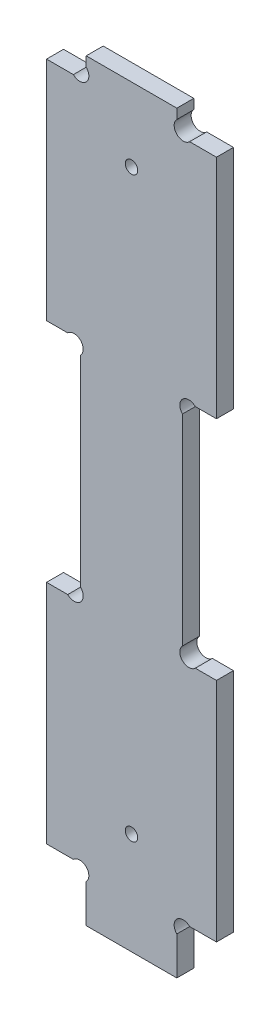
ISO-10303-21;
HEADER;
FILE_DESCRIPTION(('STEP AP214'),'2;1');
FILE_NAME('part.step','',(''),(''),'','','');
FILE_SCHEMA(('AUTOMOTIVE_DESIGN { 1 0 10303 214 1 1 1 1 }'));
ENDSEC;
DATA;
#1=APPLICATION_CONTEXT('core data for automotive mechanical design processes');
#2=APPLICATION_PROTOCOL_DEFINITION('international standard','automotive_design',2000,#1);
#3=PRODUCT_CONTEXT('',#1,'mechanical');
#4=PRODUCT('Part','Part','',(#3));
#5=PRODUCT_RELATED_PRODUCT_CATEGORY('part','',(#4));
#6=PRODUCT_DEFINITION_FORMATION('','',#4);
#7=PRODUCT_DEFINITION_CONTEXT('part definition',#1,'design');
#8=PRODUCT_DEFINITION('design','',#6,#7);
#9=PRODUCT_DEFINITION_SHAPE('','',#8);
#10=(LENGTH_UNIT() NAMED_UNIT(*) SI_UNIT(.MILLI.,.METRE.));
#11=(NAMED_UNIT(*) PLANE_ANGLE_UNIT() SI_UNIT($,.RADIAN.));
#12=(NAMED_UNIT(*) SI_UNIT($,.STERADIAN.) SOLID_ANGLE_UNIT());
#13=UNCERTAINTY_MEASURE_WITH_UNIT(LENGTH_MEASURE(1.E-05),#10,'distance_accuracy_value','');
#14=(GEOMETRIC_REPRESENTATION_CONTEXT(3) GLOBAL_UNCERTAINTY_ASSIGNED_CONTEXT((#13)) GLOBAL_UNIT_ASSIGNED_CONTEXT((#10,
#11,#12)) REPRESENTATION_CONTEXT('',''));
#15=CARTESIAN_POINT('',(0.,0.,0.));
#16=DIRECTION('',(0.,0.,1.));
#17=DIRECTION('',(1.,0.,0.));
#18=AXIS2_PLACEMENT_3D('',#15,#16,#17);
#19=CARTESIAN_POINT('',(30.,49.,3.));
#20=DIRECTION('',(-1.,0.,0.));
#21=DIRECTION('',(0.,-1.,0.));
#22=AXIS2_PLACEMENT_3D('',#19,#20,#21);
#23=PLANE('',#22);
#24=DIRECTION('',(0.,1.,0.));
#25=VECTOR('',#24,1.);
#26=CARTESIAN_POINT('',(30.,49.,0.));
#27=LINE('',#26,#25);
#28=CARTESIAN_POINT('',(30.,9.,0.));
#29=VERTEX_POINT('',#28);
#30=CARTESIAN_POINT('',(30.,49.,0.));
#31=VERTEX_POINT('',#30);
#32=EDGE_CURVE('E248',#29,#31,#27,.T.);
#33=ORIENTED_EDGE('',*,*,#32,.T.);
#34=DIRECTION('',(0.,0.,-1.));
#35=VECTOR('',#34,1.);
#36=CARTESIAN_POINT('',(30.,49.,3.));
#37=LINE('',#36,#35);
#38=CARTESIAN_POINT('',(30.,49.,3.));
#39=VERTEX_POINT('',#38);
#40=EDGE_CURVE('E11',#39,#31,#37,.T.);
#41=ORIENTED_EDGE('',*,*,#40,.F.);
#42=DIRECTION('',(0.,1.,0.));
#43=VECTOR('',#42,1.);
#44=CARTESIAN_POINT('',(30.,49.,3.));
#45=LINE('',#44,#43);
#46=CARTESIAN_POINT('',(30.,9.,3.));
#47=VERTEX_POINT('',#46);
#48=EDGE_CURVE('E303',#47,#39,#45,.T.);
#49=ORIENTED_EDGE('',*,*,#48,.F.);
#50=DIRECTION('',(0.,0.,-1.));
#51=VECTOR('',#50,1.);
#52=CARTESIAN_POINT('',(30.,9.,3.));
#53=LINE('',#52,#51);
#54=EDGE_CURVE('E244',#47,#29,#53,.T.);
#55=ORIENTED_EDGE('',*,*,#54,.T.);
#56=EDGE_LOOP('',(#33,#41,#49,#55));
#57=FACE_BOUND('',#56,.T.);
#58=ADVANCED_FACE('F32',(#57),#23,.F.);
#59=CARTESIAN_POINT('',(26.262741699797,49.,3.));
#60=DIRECTION('',(0.,-1.,0.));
#61=DIRECTION('',(0.,0.,-1.));
#62=AXIS2_PLACEMENT_3D('',#59,#60,#61);
#63=PLANE('',#62);
#64=DIRECTION('',(-1.,0.,0.));
#65=VECTOR('',#64,1.);
#66=CARTESIAN_POINT('',(26.262741699797,49.,0.));
#67=LINE('',#66,#65);
#68=CARTESIAN_POINT('',(26.262741699797,49.,0.));
#69=VERTEX_POINT('',#68);
#70=EDGE_CURVE('E251',#31,#69,#67,.T.);
#71=ORIENTED_EDGE('',*,*,#70,.T.);
#72=DIRECTION('',(0.,0.,-1.));
#73=VECTOR('',#72,1.);
#74=CARTESIAN_POINT('',(26.262741699797,49.,3.));
#75=LINE('',#74,#73);
#76=CARTESIAN_POINT('',(26.262741699797,49.,3.));
#77=VERTEX_POINT('',#76);
#78=EDGE_CURVE('E40',#77,#69,#75,.T.);
#79=ORIENTED_EDGE('',*,*,#78,.F.);
#80=DIRECTION('',(-1.,0.,0.));
#81=VECTOR('',#80,1.);
#82=CARTESIAN_POINT('',(26.262741699797,49.,3.));
#83=LINE('',#82,#81);
#84=EDGE_CURVE('E151',#39,#77,#83,.T.);
#85=ORIENTED_EDGE('',*,*,#84,.F.);
#86=ORIENTED_EDGE('',*,*,#40,.T.);
#87=EDGE_LOOP('',(#71,#79,#85,#86));
#88=FACE_BOUND('',#87,.T.);
#89=ADVANCED_FACE('F463',(#88),#63,.F.);
#90=CARTESIAN_POINT('',(25.1313708498985,50.1313708498985,3.));
#91=DIRECTION('',(0.,0.,-1.));
#92=DIRECTION('',(-1.,0.,0.));
#93=AXIS2_PLACEMENT_3D('',#90,#91,#92);
#94=CYLINDRICAL_SURFACE('',#93,1.60000000000001);
#95=CARTESIAN_POINT('',(25.1313708498985,50.1313708498985,0.));
#96=DIRECTION('',(0.,0.,-1.));
#97=DIRECTION('',(1.,0.,0.));
#98=AXIS2_PLACEMENT_3D('',#95,#96,#97);
#99=CIRCLE('',#98,1.60000000000001);
#100=CARTESIAN_POINT('',(24.,51.262741699797,0.));
#101=VERTEX_POINT('',#100);
#102=EDGE_CURVE('E254',#69,#101,#99,.T.);
#103=ORIENTED_EDGE('',*,*,#102,.T.);
#104=DIRECTION('',(0.,0.,-1.));
#105=VECTOR('',#104,1.);
#106=CARTESIAN_POINT('',(24.,51.262741699797,3.));
#107=LINE('',#106,#105);
#108=CARTESIAN_POINT('',(24.,51.262741699797,3.));
#109=VERTEX_POINT('',#108);
#110=EDGE_CURVE('E370',#109,#101,#107,.T.);
#111=ORIENTED_EDGE('',*,*,#110,.F.);
#112=CARTESIAN_POINT('',(25.1313708498985,50.1313708498985,3.));
#113=DIRECTION('',(0.,0.,-1.));
#114=DIRECTION('',(1.,0.,0.));
#115=AXIS2_PLACEMENT_3D('',#112,#113,#114);
#116=CIRCLE('',#115,1.60000000000001);
#117=EDGE_CURVE('E378',#77,#109,#116,.T.);
#118=ORIENTED_EDGE('',*,*,#117,.F.);
#119=ORIENTED_EDGE('',*,*,#78,.T.);
#120=EDGE_LOOP('',(#103,#111,#118,#119));
#121=FACE_BOUND('',#120,.T.);
#122=ADVANCED_FACE('F376',(#121),#94,.F.);
#123=CARTESIAN_POINT('',(24.,86.737258300203,3.));
#124=DIRECTION('',(-1.,0.,0.));
#125=DIRECTION('',(0.,-1.,0.));
#126=AXIS2_PLACEMENT_3D('',#123,#124,#125);
#127=PLANE('',#126);
#128=DIRECTION('',(0.,1.,0.));
#129=VECTOR('',#128,1.);
#130=CARTESIAN_POINT('',(24.,86.737258300203,0.));
#131=LINE('',#130,#129);
#132=CARTESIAN_POINT('',(24.,86.737258300203,0.));
#133=VERTEX_POINT('',#132);
#134=EDGE_CURVE('E256',#101,#133,#131,.T.);
#135=ORIENTED_EDGE('',*,*,#134,.T.);
#136=DIRECTION('',(0.,0.,-1.));
#137=VECTOR('',#136,1.);
#138=CARTESIAN_POINT('',(24.,86.737258300203,3.));
#139=LINE('',#138,#137);
#140=CARTESIAN_POINT('',(24.,86.737258300203,3.));
#141=VERTEX_POINT('',#140);
#142=EDGE_CURVE('E367',#141,#133,#139,.T.);
#143=ORIENTED_EDGE('',*,*,#142,.F.);
#144=DIRECTION('',(0.,1.,0.));
#145=VECTOR('',#144,1.);
#146=CARTESIAN_POINT('',(24.,86.737258300203,3.));
#147=LINE('',#146,#145);
#148=EDGE_CURVE('E396',#109,#141,#147,.T.);
#149=ORIENTED_EDGE('',*,*,#148,.F.);
#150=ORIENTED_EDGE('',*,*,#110,.T.);
#151=EDGE_LOOP('',(#135,#143,#149,#150));
#152=FACE_BOUND('',#151,.T.);
#153=ADVANCED_FACE('F387',(#152),#127,.F.);
#154=CARTESIAN_POINT('',(25.1313708498985,87.8686291501015,3.));
#155=DIRECTION('',(0.,0.,-1.));
#156=DIRECTION('',(-1.,0.,0.));
#157=AXIS2_PLACEMENT_3D('',#154,#155,#156);
#158=CYLINDRICAL_SURFACE('',#157,1.6);
#159=CARTESIAN_POINT('',(25.1313708498985,87.8686291501015,0.));
#160=DIRECTION('',(0.,0.,-1.));
#161=DIRECTION('',(-1.,0.,0.));
#162=AXIS2_PLACEMENT_3D('',#159,#160,#161);
#163=CIRCLE('',#162,1.6);
#164=CARTESIAN_POINT('',(26.2627416997969,89.,0.));
#165=VERTEX_POINT('',#164);
#166=EDGE_CURVE('E258',#133,#165,#163,.T.);
#167=ORIENTED_EDGE('',*,*,#166,.T.);
#168=DIRECTION('',(0.,0.,-1.));
#169=VECTOR('',#168,1.);
#170=CARTESIAN_POINT('',(26.2627416997969,89.,3.));
#171=LINE('',#170,#169);
#172=CARTESIAN_POINT('',(26.2627416997969,89.,3.));
#173=VERTEX_POINT('',#172);
#174=EDGE_CURVE('E364',#173,#165,#171,.T.);
#175=ORIENTED_EDGE('',*,*,#174,.F.);
#176=CARTESIAN_POINT('',(25.1313708498985,87.8686291501015,3.));
#177=DIRECTION('',(0.,0.,-1.));
#178=DIRECTION('',(-1.,0.,0.));
#179=AXIS2_PLACEMENT_3D('',#176,#177,#178);
#180=CIRCLE('',#179,1.6);
#181=EDGE_CURVE('E393',#141,#173,#180,.T.);
#182=ORIENTED_EDGE('',*,*,#181,.F.);
#183=ORIENTED_EDGE('',*,*,#142,.T.);
#184=EDGE_LOOP('',(#167,#175,#182,#183));
#185=FACE_BOUND('',#184,.T.);
#186=ADVANCED_FACE('F391',(#185),#158,.F.);
#187=CARTESIAN_POINT('',(26.2627416997969,89.,3.));
#188=DIRECTION('',(0.,1.,0.));
#189=DIRECTION('',(0.,0.,1.));
#190=AXIS2_PLACEMENT_3D('',#187,#188,#189);
#191=PLANE('',#190);
#192=DIRECTION('',(1.,0.,0.));
#193=VECTOR('',#192,1.);
#194=CARTESIAN_POINT('',(26.2627416997969,89.,0.));
#195=LINE('',#194,#193);
#196=CARTESIAN_POINT('',(30.,89.,0.));
#197=VERTEX_POINT('',#196);
#198=EDGE_CURVE('E260',#165,#197,#195,.T.);
#199=ORIENTED_EDGE('',*,*,#198,.T.);
#200=DIRECTION('',(0.,0.,-1.));
#201=VECTOR('',#200,1.);
#202=CARTESIAN_POINT('',(30.,89.,3.));
#203=LINE('',#202,#201);
#204=CARTESIAN_POINT('',(30.,89.,3.));
#205=VERTEX_POINT('',#204);
#206=EDGE_CURVE('E361',#205,#197,#203,.T.);
#207=ORIENTED_EDGE('',*,*,#206,.F.);
#208=DIRECTION('',(1.,0.,0.));
#209=VECTOR('',#208,1.);
#210=CARTESIAN_POINT('',(26.2627416997969,89.,3.));
#211=LINE('',#210,#209);
#212=EDGE_CURVE('E395',#173,#205,#211,.T.);
#213=ORIENTED_EDGE('',*,*,#212,.F.);
#214=ORIENTED_EDGE('',*,*,#174,.T.);
#215=EDGE_LOOP('',(#199,#207,#213,#214));
#216=FACE_BOUND('',#215,.T.);
#217=ADVANCED_FACE('F476',(#216),#191,.F.);
#218=CARTESIAN_POINT('',(30.,89.,3.));
#219=DIRECTION('',(-1.,0.,0.));
#220=DIRECTION('',(0.,0.,1.));
#221=AXIS2_PLACEMENT_3D('',#218,#219,#220);
#222=PLANE('',#221);
#223=DIRECTION('',(0.,1.,0.));
#224=VECTOR('',#223,1.);
#225=CARTESIAN_POINT('',(30.,89.,0.));
#226=LINE('',#225,#224);
#227=CARTESIAN_POINT('',(30.,129.,0.));
#228=VERTEX_POINT('',#227);
#229=EDGE_CURVE('E262',#197,#228,#226,.T.);
#230=ORIENTED_EDGE('',*,*,#229,.T.);
#231=DIRECTION('',(0.,0.,-1.));
#232=VECTOR('',#231,1.);
#233=CARTESIAN_POINT('',(30.,129.,3.));
#234=LINE('',#233,#232);
#235=CARTESIAN_POINT('',(30.,129.,3.));
#236=VERTEX_POINT('',#235);
#237=EDGE_CURVE('E358',#236,#228,#234,.T.);
#238=ORIENTED_EDGE('',*,*,#237,.F.);
#239=DIRECTION('',(0.,1.,0.));
#240=VECTOR('',#239,1.);
#241=CARTESIAN_POINT('',(30.,89.,3.));
#242=LINE('',#241,#240);
#243=EDGE_CURVE('E398',#205,#236,#242,.T.);
#244=ORIENTED_EDGE('',*,*,#243,.F.);
#245=ORIENTED_EDGE('',*,*,#206,.T.);
#246=EDGE_LOOP('',(#230,#238,#244,#245));
#247=FACE_BOUND('',#246,.T.);
#248=ADVANCED_FACE('F479',(#247),#222,.F.);
#249=CARTESIAN_POINT('',(25.262741699797,129.,3.));
#250=DIRECTION('',(0.,-1.,0.));
#251=DIRECTION('',(0.,0.,-1.));
#252=AXIS2_PLACEMENT_3D('',#249,#250,#251);
#253=PLANE('',#252);
#254=DIRECTION('',(-1.,0.,0.));
#255=VECTOR('',#254,1.);
#256=CARTESIAN_POINT('',(25.262741699797,129.,0.));
#257=LINE('',#256,#255);
#258=CARTESIAN_POINT('',(25.262741699797,129.,0.));
#259=VERTEX_POINT('',#258);
#260=EDGE_CURVE('E264',#228,#259,#257,.T.);
#261=ORIENTED_EDGE('',*,*,#260,.T.);
#262=DIRECTION('',(0.,0.,-1.));
#263=VECTOR('',#262,1.);
#264=CARTESIAN_POINT('',(25.262741699797,129.,3.));
#265=LINE('',#264,#263);
#266=CARTESIAN_POINT('',(25.262741699797,129.,3.));
#267=VERTEX_POINT('',#266);
#268=EDGE_CURVE('E355',#267,#259,#265,.T.);
#269=ORIENTED_EDGE('',*,*,#268,.F.);
#270=DIRECTION('',(-1.,0.,0.));
#271=VECTOR('',#270,1.);
#272=CARTESIAN_POINT('',(25.262741699797,129.,3.));
#273=LINE('',#272,#271);
#274=EDGE_CURVE('E404',#236,#267,#273,.T.);
#275=ORIENTED_EDGE('',*,*,#274,.F.);
#276=ORIENTED_EDGE('',*,*,#237,.T.);
#277=EDGE_LOOP('',(#261,#269,#275,#276));
#278=FACE_BOUND('',#277,.T.);
#279=ADVANCED_FACE('F483',(#278),#253,.F.);
#280=CARTESIAN_POINT('',(24.1313708498985,130.131370849898,3.));
#281=DIRECTION('',(0.,0.,-1.));
#282=DIRECTION('',(-1.,0.,0.));
#283=AXIS2_PLACEMENT_3D('',#280,#281,#282);
#284=CYLINDRICAL_SURFACE('',#283,1.60000000000001);
#285=CARTESIAN_POINT('',(24.1313708498985,130.131370849898,0.));
#286=DIRECTION('',(0.,0.,-1.));
#287=DIRECTION('',(-1.,0.,0.));
#288=AXIS2_PLACEMENT_3D('',#285,#286,#287);
#289=CIRCLE('',#288,1.60000000000001);
#290=CARTESIAN_POINT('',(23.,131.262741699797,0.));
#291=VERTEX_POINT('',#290);
#292=EDGE_CURVE('E266',#259,#291,#289,.T.);
#293=ORIENTED_EDGE('',*,*,#292,.T.);
#294=DIRECTION('',(0.,0.,-1.));
#295=VECTOR('',#294,1.);
#296=CARTESIAN_POINT('',(23.,131.262741699797,3.));
#297=LINE('',#296,#295);
#298=CARTESIAN_POINT('',(23.,131.262741699797,3.));
#299=VERTEX_POINT('',#298);
#300=EDGE_CURVE('E352',#299,#291,#297,.T.);
#301=ORIENTED_EDGE('',*,*,#300,.F.);
#302=CARTESIAN_POINT('',(24.1313708498985,130.131370849898,3.));
#303=DIRECTION('',(0.,0.,-1.));
#304=DIRECTION('',(-1.,0.,0.));
#305=AXIS2_PLACEMENT_3D('',#302,#303,#304);
#306=CIRCLE('',#305,1.60000000000001);
#307=EDGE_CURVE('E406',#267,#299,#306,.T.);
#308=ORIENTED_EDGE('',*,*,#307,.F.);
#309=ORIENTED_EDGE('',*,*,#268,.T.);
#310=EDGE_LOOP('',(#293,#301,#308,#309));
#311=FACE_BOUND('',#310,.T.);
#312=ADVANCED_FACE('F487',(#311),#284,.F.);
#313=CARTESIAN_POINT('',(23.,131.262741699797,3.));
#314=DIRECTION('',(-1.,0.,0.));
#315=DIRECTION('',(0.,0.,1.));
#316=AXIS2_PLACEMENT_3D('',#313,#314,#315);
#317=PLANE('',#316);
#318=DIRECTION('',(0.,1.,0.));
#319=VECTOR('',#318,1.);
#320=CARTESIAN_POINT('',(23.,131.262741699797,0.));
#321=LINE('',#320,#319);
#322=CARTESIAN_POINT('',(23.,133.,0.));
#323=VERTEX_POINT('',#322);
#324=EDGE_CURVE('E268',#291,#323,#321,.T.);
#325=ORIENTED_EDGE('',*,*,#324,.T.);
#326=DIRECTION('',(0.,0.,-1.));
#327=VECTOR('',#326,1.);
#328=CARTESIAN_POINT('',(23.,133.,3.));
#329=LINE('',#328,#327);
#330=CARTESIAN_POINT('',(23.,133.,3.));
#331=VERTEX_POINT('',#330);
#332=EDGE_CURVE('E349',#331,#323,#329,.T.);
#333=ORIENTED_EDGE('',*,*,#332,.F.);
#334=DIRECTION('',(0.,1.,0.));
#335=VECTOR('',#334,1.);
#336=CARTESIAN_POINT('',(23.,131.262741699797,3.));
#337=LINE('',#336,#335);
#338=EDGE_CURVE('E408',#299,#331,#337,.T.);
#339=ORIENTED_EDGE('',*,*,#338,.F.);
#340=ORIENTED_EDGE('',*,*,#300,.T.);
#341=EDGE_LOOP('',(#325,#333,#339,#340));
#342=FACE_BOUND('',#341,.T.);
#343=ADVANCED_FACE('F491',(#342),#317,.F.);
#344=CARTESIAN_POINT('',(6.99999999999998,133.,3.));
#345=DIRECTION('',(0.,-1.,0.));
#346=DIRECTION('',(0.,0.,-1.));
#347=AXIS2_PLACEMENT_3D('',#344,#345,#346);
#348=PLANE('',#347);
#349=DIRECTION('',(-1.,0.,0.));
#350=VECTOR('',#349,1.);
#351=CARTESIAN_POINT('',(6.99999999999998,133.,0.));
#352=LINE('',#351,#350);
#353=CARTESIAN_POINT('',(6.99999999999998,133.,0.));
#354=VERTEX_POINT('',#353);
#355=EDGE_CURVE('E270',#323,#354,#352,.T.);
#356=ORIENTED_EDGE('',*,*,#355,.T.);
#357=DIRECTION('',(0.,0.,-1.));
#358=VECTOR('',#357,1.);
#359=CARTESIAN_POINT('',(6.99999999999998,133.,3.));
#360=LINE('',#359,#358);
#361=CARTESIAN_POINT('',(6.99999999999998,133.,3.));
#362=VERTEX_POINT('',#361);
#363=EDGE_CURVE('E346',#362,#354,#360,.T.);
#364=ORIENTED_EDGE('',*,*,#363,.F.);
#365=DIRECTION('',(-1.,0.,0.));
#366=VECTOR('',#365,1.);
#367=CARTESIAN_POINT('',(6.99999999999998,133.,3.));
#368=LINE('',#367,#366);
#369=EDGE_CURVE('E410',#331,#362,#368,.T.);
#370=ORIENTED_EDGE('',*,*,#369,.F.);
#371=ORIENTED_EDGE('',*,*,#332,.T.);
#372=EDGE_LOOP('',(#356,#364,#370,#371));
#373=FACE_BOUND('',#372,.T.);
#374=ADVANCED_FACE('F495',(#373),#348,.F.);
#375=CARTESIAN_POINT('',(6.99999999999998,131.262741699797,3.));
#376=DIRECTION('',(1.,0.,0.));
#377=DIRECTION('',(0.,0.,-1.));
#378=AXIS2_PLACEMENT_3D('',#375,#376,#377);
#379=PLANE('',#378);
#380=DIRECTION('',(0.,-1.,0.));
#381=VECTOR('',#380,1.);
#382=CARTESIAN_POINT('',(6.99999999999998,131.262741699797,0.));
#383=LINE('',#382,#381);
#384=CARTESIAN_POINT('',(6.99999999999998,131.262741699797,0.));
#385=VERTEX_POINT('',#384);
#386=EDGE_CURVE('E272',#354,#385,#383,.T.);
#387=ORIENTED_EDGE('',*,*,#386,.T.);
#388=DIRECTION('',(0.,0.,-1.));
#389=VECTOR('',#388,1.);
#390=CARTESIAN_POINT('',(6.99999999999998,131.262741699797,3.));
#391=LINE('',#390,#389);
#392=CARTESIAN_POINT('',(6.99999999999998,131.262741699797,3.));
#393=VERTEX_POINT('',#392);
#394=EDGE_CURVE('E343',#393,#385,#391,.T.);
#395=ORIENTED_EDGE('',*,*,#394,.F.);
#396=DIRECTION('',(0.,-1.,0.));
#397=VECTOR('',#396,1.);
#398=CARTESIAN_POINT('',(6.99999999999998,131.262741699797,3.));
#399=LINE('',#398,#397);
#400=EDGE_CURVE('E412',#362,#393,#399,.T.);
#401=ORIENTED_EDGE('',*,*,#400,.F.);
#402=ORIENTED_EDGE('',*,*,#363,.T.);
#403=EDGE_LOOP('',(#387,#395,#401,#402));
#404=FACE_BOUND('',#403,.T.);
#405=ADVANCED_FACE('F499',(#404),#379,.F.);
#406=CARTESIAN_POINT('',(5.8686291501015,130.131370849898,3.));
#407=DIRECTION('',(0.,0.,-1.));
#408=DIRECTION('',(-1.,0.,0.));
#409=AXIS2_PLACEMENT_3D('',#406,#407,#408);
#410=CYLINDRICAL_SURFACE('',#409,1.6);
#411=CARTESIAN_POINT('',(5.8686291501015,130.131370849898,0.));
#412=DIRECTION('',(0.,0.,-1.));
#413=DIRECTION('',(1.,0.,0.));
#414=AXIS2_PLACEMENT_3D('',#411,#412,#413);
#415=CIRCLE('',#414,1.6);
#416=CARTESIAN_POINT('',(4.73725830020302,129.,0.));
#417=VERTEX_POINT('',#416);
#418=EDGE_CURVE('E274',#385,#417,#415,.T.);
#419=ORIENTED_EDGE('',*,*,#418,.T.);
#420=DIRECTION('',(0.,0.,-1.));
#421=VECTOR('',#420,1.);
#422=CARTESIAN_POINT('',(4.73725830020302,129.,3.));
#423=LINE('',#422,#421);
#424=CARTESIAN_POINT('',(4.73725830020302,129.,3.));
#425=VERTEX_POINT('',#424);
#426=EDGE_CURVE('E340',#425,#417,#423,.T.);
#427=ORIENTED_EDGE('',*,*,#426,.F.);
#428=CARTESIAN_POINT('',(5.8686291501015,130.131370849898,3.));
#429=DIRECTION('',(0.,0.,-1.));
#430=DIRECTION('',(1.,0.,0.));
#431=AXIS2_PLACEMENT_3D('',#428,#429,#430);
#432=CIRCLE('',#431,1.6);
#433=EDGE_CURVE('E414',#393,#425,#432,.T.);
#434=ORIENTED_EDGE('',*,*,#433,.F.);
#435=ORIENTED_EDGE('',*,*,#394,.T.);
#436=EDGE_LOOP('',(#419,#427,#434,#435));
#437=FACE_BOUND('',#436,.T.);
#438=ADVANCED_FACE('F503',(#437),#410,.F.);
#439=CARTESIAN_POINT('',(4.73725830020302,129.,3.));
#440=DIRECTION('',(0.,-1.,0.));
#441=DIRECTION('',(0.,0.,-1.));
#442=AXIS2_PLACEMENT_3D('',#439,#440,#441);
#443=PLANE('',#442);
#444=DIRECTION('',(-1.,0.,0.));
#445=VECTOR('',#444,1.);
#446=CARTESIAN_POINT('',(4.73725830020302,129.,0.));
#447=LINE('',#446,#445);
#448=CARTESIAN_POINT('',(0.,129.,0.));
#449=VERTEX_POINT('',#448);
#450=EDGE_CURVE('E276',#417,#449,#447,.T.);
#451=ORIENTED_EDGE('',*,*,#450,.T.);
#452=DIRECTION('',(0.,0.,-1.));
#453=VECTOR('',#452,1.);
#454=CARTESIAN_POINT('',(0.,129.,3.));
#455=LINE('',#454,#453);
#456=CARTESIAN_POINT('',(0.,129.,3.));
#457=VERTEX_POINT('',#456);
#458=EDGE_CURVE('E337',#457,#449,#455,.T.);
#459=ORIENTED_EDGE('',*,*,#458,.F.);
#460=DIRECTION('',(-1.,0.,0.));
#461=VECTOR('',#460,1.);
#462=CARTESIAN_POINT('',(4.73725830020302,129.,3.));
#463=LINE('',#462,#461);
#464=EDGE_CURVE('E416',#425,#457,#463,.T.);
#465=ORIENTED_EDGE('',*,*,#464,.F.);
#466=ORIENTED_EDGE('',*,*,#426,.T.);
#467=EDGE_LOOP('',(#451,#459,#465,#466));
#468=FACE_BOUND('',#467,.T.);
#469=ADVANCED_FACE('F507',(#468),#443,.F.);
#470=CARTESIAN_POINT('',(0.,89.,3.));
#471=DIRECTION('',(1.,0.,0.));
#472=DIRECTION('',(0.,1.,0.));
#473=AXIS2_PLACEMENT_3D('',#470,#471,#472);
#474=PLANE('',#473);
#475=DIRECTION('',(0.,-1.,0.));
#476=VECTOR('',#475,1.);
#477=CARTESIAN_POINT('',(0.,89.,0.));
#478=LINE('',#477,#476);
#479=CARTESIAN_POINT('',(0.,89.,0.));
#480=VERTEX_POINT('',#479);
#481=EDGE_CURVE('E278',#449,#480,#478,.T.);
#482=ORIENTED_EDGE('',*,*,#481,.T.);
#483=DIRECTION('',(0.,0.,-1.));
#484=VECTOR('',#483,1.);
#485=CARTESIAN_POINT('',(0.,89.,3.));
#486=LINE('',#485,#484);
#487=CARTESIAN_POINT('',(0.,89.,3.));
#488=VERTEX_POINT('',#487);
#489=EDGE_CURVE('E334',#488,#480,#486,.T.);
#490=ORIENTED_EDGE('',*,*,#489,.F.);
#491=DIRECTION('',(0.,-1.,0.));
#492=VECTOR('',#491,1.);
#493=CARTESIAN_POINT('',(0.,89.,3.));
#494=LINE('',#493,#492);
#495=EDGE_CURVE('E418',#457,#488,#494,.T.);
#496=ORIENTED_EDGE('',*,*,#495,.F.);
#497=ORIENTED_EDGE('',*,*,#458,.T.);
#498=EDGE_LOOP('',(#482,#490,#496,#497));
#499=FACE_BOUND('',#498,.T.);
#500=ADVANCED_FACE('F511',(#499),#474,.F.);
#501=CARTESIAN_POINT('',(3.73725830020304,89.,3.));
#502=DIRECTION('',(0.,1.,0.));
#503=DIRECTION('',(0.,0.,1.));
#504=AXIS2_PLACEMENT_3D('',#501,#502,#503);
#505=PLANE('',#504);
#506=DIRECTION('',(1.,0.,0.));
#507=VECTOR('',#506,1.);
#508=CARTESIAN_POINT('',(3.73725830020304,89.,0.));
#509=LINE('',#508,#507);
#510=CARTESIAN_POINT('',(3.73725830020304,89.,0.));
#511=VERTEX_POINT('',#510);
#512=EDGE_CURVE('E280',#480,#511,#509,.T.);
#513=ORIENTED_EDGE('',*,*,#512,.T.);
#514=DIRECTION('',(0.,0.,-1.));
#515=VECTOR('',#514,1.);
#516=CARTESIAN_POINT('',(3.73725830020304,89.,3.));
#517=LINE('',#516,#515);
#518=CARTESIAN_POINT('',(3.73725830020304,89.,3.));
#519=VERTEX_POINT('',#518);
#520=EDGE_CURVE('E331',#519,#511,#517,.T.);
#521=ORIENTED_EDGE('',*,*,#520,.F.);
#522=DIRECTION('',(1.,0.,0.));
#523=VECTOR('',#522,1.);
#524=CARTESIAN_POINT('',(3.73725830020304,89.,3.));
#525=LINE('',#524,#523);
#526=EDGE_CURVE('E420',#488,#519,#525,.T.);
#527=ORIENTED_EDGE('',*,*,#526,.F.);
#528=ORIENTED_EDGE('',*,*,#489,.T.);
#529=EDGE_LOOP('',(#513,#521,#527,#528));
#530=FACE_BOUND('',#529,.T.);
#531=ADVANCED_FACE('F515',(#530),#505,.F.);
#532=CARTESIAN_POINT('',(4.86862915010152,87.8686291501015,3.));
#533=DIRECTION('',(0.,0.,-1.));
#534=DIRECTION('',(-1.,0.,0.));
#535=AXIS2_PLACEMENT_3D('',#532,#533,#534);
#536=CYLINDRICAL_SURFACE('',#535,1.6);
#537=CARTESIAN_POINT('',(4.86862915010152,87.8686291501015,0.));
#538=DIRECTION('',(0.,0.,-1.));
#539=DIRECTION('',(1.,0.,0.));
#540=AXIS2_PLACEMENT_3D('',#537,#538,#539);
#541=CIRCLE('',#540,1.6);
#542=CARTESIAN_POINT('',(5.99999999999999,86.737258300203,0.));
#543=VERTEX_POINT('',#542);
#544=EDGE_CURVE('E282',#511,#543,#541,.T.);
#545=ORIENTED_EDGE('',*,*,#544,.T.);
#546=DIRECTION('',(0.,0.,-1.));
#547=VECTOR('',#546,1.);
#548=CARTESIAN_POINT('',(5.99999999999999,86.737258300203,3.));
#549=LINE('',#548,#547);
#550=CARTESIAN_POINT('',(5.99999999999999,86.737258300203,3.));
#551=VERTEX_POINT('',#550);
#552=EDGE_CURVE('E328',#551,#543,#549,.T.);
#553=ORIENTED_EDGE('',*,*,#552,.F.);
#554=CARTESIAN_POINT('',(4.86862915010152,87.8686291501015,3.));
#555=DIRECTION('',(0.,0.,-1.));
#556=DIRECTION('',(1.,0.,0.));
#557=AXIS2_PLACEMENT_3D('',#554,#555,#556);
#558=CIRCLE('',#557,1.6);
#559=EDGE_CURVE('E422',#519,#551,#558,.T.);
#560=ORIENTED_EDGE('',*,*,#559,.F.);
#561=ORIENTED_EDGE('',*,*,#520,.T.);
#562=EDGE_LOOP('',(#545,#553,#560,#561));
#563=FACE_BOUND('',#562,.T.);
#564=ADVANCED_FACE('F519',(#563),#536,.F.);
#565=CARTESIAN_POINT('',(5.99999999999999,86.737258300203,3.));
#566=DIRECTION('',(1.,0.,0.));
#567=DIRECTION('',(0.,1.,0.));
#568=AXIS2_PLACEMENT_3D('',#565,#566,#567);
#569=PLANE('',#568);
#570=DIRECTION('',(0.,-1.,0.));
#571=VECTOR('',#570,1.);
#572=CARTESIAN_POINT('',(5.99999999999999,86.737258300203,0.));
#573=LINE('',#572,#571);
#574=CARTESIAN_POINT('',(6.,51.262741699797,0.));
#575=VERTEX_POINT('',#574);
#576=EDGE_CURVE('E284',#543,#575,#573,.T.);
#577=ORIENTED_EDGE('',*,*,#576,.T.);
#578=DIRECTION('',(0.,0.,-1.));
#579=VECTOR('',#578,1.);
#580=CARTESIAN_POINT('',(6.,51.262741699797,3.));
#581=LINE('',#580,#579);
#582=CARTESIAN_POINT('',(6.,51.262741699797,3.));
#583=VERTEX_POINT('',#582);
#584=EDGE_CURVE('E325',#583,#575,#581,.T.);
#585=ORIENTED_EDGE('',*,*,#584,.F.);
#586=DIRECTION('',(0.,-1.,0.));
#587=VECTOR('',#586,1.);
#588=CARTESIAN_POINT('',(5.99999999999999,86.737258300203,3.));
#589=LINE('',#588,#587);
#590=EDGE_CURVE('E424',#551,#583,#589,.T.);
#591=ORIENTED_EDGE('',*,*,#590,.F.);
#592=ORIENTED_EDGE('',*,*,#552,.T.);
#593=EDGE_LOOP('',(#577,#585,#591,#592));
#594=FACE_BOUND('',#593,.T.);
#595=ADVANCED_FACE('F523',(#594),#569,.F.);
#596=CARTESIAN_POINT('',(4.86862915010152,50.1313708498985,3.));
#597=DIRECTION('',(0.,0.,-1.));
#598=DIRECTION('',(-1.,0.,0.));
#599=AXIS2_PLACEMENT_3D('',#596,#597,#598);
#600=CYLINDRICAL_SURFACE('',#599,1.6);
#601=CARTESIAN_POINT('',(4.86862915010152,50.1313708498985,0.));
#602=DIRECTION('',(0.,0.,-1.));
#603=DIRECTION('',(-1.,0.,0.));
#604=AXIS2_PLACEMENT_3D('',#601,#602,#603);
#605=CIRCLE('',#604,1.6);
#606=CARTESIAN_POINT('',(3.73725830020305,49.,0.));
#607=VERTEX_POINT('',#606);
#608=EDGE_CURVE('E286',#575,#607,#605,.T.);
#609=ORIENTED_EDGE('',*,*,#608,.T.);
#610=DIRECTION('',(0.,0.,-1.));
#611=VECTOR('',#610,1.);
#612=CARTESIAN_POINT('',(3.73725830020305,49.,3.));
#613=LINE('',#612,#611);
#614=CARTESIAN_POINT('',(3.73725830020305,49.,3.));
#615=VERTEX_POINT('',#614);
#616=EDGE_CURVE('E322',#615,#607,#613,.T.);
#617=ORIENTED_EDGE('',*,*,#616,.F.);
#618=CARTESIAN_POINT('',(4.86862915010152,50.1313708498985,3.));
#619=DIRECTION('',(0.,0.,-1.));
#620=DIRECTION('',(-1.,0.,0.));
#621=AXIS2_PLACEMENT_3D('',#618,#619,#620);
#622=CIRCLE('',#621,1.6);
#623=EDGE_CURVE('E426',#583,#615,#622,.T.);
#624=ORIENTED_EDGE('',*,*,#623,.F.);
#625=ORIENTED_EDGE('',*,*,#584,.T.);
#626=EDGE_LOOP('',(#609,#617,#624,#625));
#627=FACE_BOUND('',#626,.T.);
#628=ADVANCED_FACE('F527',(#627),#600,.F.);
#629=CARTESIAN_POINT('',(3.73725830020305,49.,3.));
#630=DIRECTION('',(0.,-1.,0.));
#631=DIRECTION('',(0.,0.,-1.));
#632=AXIS2_PLACEMENT_3D('',#629,#630,#631);
#633=PLANE('',#632);
#634=DIRECTION('',(-1.,0.,0.));
#635=VECTOR('',#634,1.);
#636=CARTESIAN_POINT('',(3.73725830020305,49.,0.));
#637=LINE('',#636,#635);
#638=CARTESIAN_POINT('',(0.,49.,0.));
#639=VERTEX_POINT('',#638);
#640=EDGE_CURVE('E288',#607,#639,#637,.T.);
#641=ORIENTED_EDGE('',*,*,#640,.T.);
#642=DIRECTION('',(0.,0.,-1.));
#643=VECTOR('',#642,1.);
#644=CARTESIAN_POINT('',(0.,49.,3.));
#645=LINE('',#644,#643);
#646=CARTESIAN_POINT('',(0.,49.,3.));
#647=VERTEX_POINT('',#646);
#648=EDGE_CURVE('E319',#647,#639,#645,.T.);
#649=ORIENTED_EDGE('',*,*,#648,.F.);
#650=DIRECTION('',(-1.,0.,0.));
#651=VECTOR('',#650,1.);
#652=CARTESIAN_POINT('',(3.73725830020305,49.,3.));
#653=LINE('',#652,#651);
#654=EDGE_CURVE('E428',#615,#647,#653,.T.);
#655=ORIENTED_EDGE('',*,*,#654,.F.);
#656=ORIENTED_EDGE('',*,*,#616,.T.);
#657=EDGE_LOOP('',(#641,#649,#655,#656));
#658=FACE_BOUND('',#657,.T.);
#659=ADVANCED_FACE('F531',(#658),#633,.F.);
#660=CARTESIAN_POINT('',(0.,49.,3.));
#661=DIRECTION('',(1.,0.,0.));
#662=DIRECTION('',(0.,1.,0.));
#663=AXIS2_PLACEMENT_3D('',#660,#661,#662);
#664=PLANE('',#663);
#665=DIRECTION('',(0.,-1.,0.));
#666=VECTOR('',#665,1.);
#667=CARTESIAN_POINT('',(0.,49.,0.));
#668=LINE('',#667,#666);
#669=CARTESIAN_POINT('',(0.,9.,0.));
#670=VERTEX_POINT('',#669);
#671=EDGE_CURVE('E290',#639,#670,#668,.T.);
#672=ORIENTED_EDGE('',*,*,#671,.T.);
#673=DIRECTION('',(0.,0.,-1.));
#674=VECTOR('',#673,1.);
#675=CARTESIAN_POINT('',(0.,9.,3.));
#676=LINE('',#675,#674);
#677=CARTESIAN_POINT('',(0.,9.,3.));
#678=VERTEX_POINT('',#677);
#679=EDGE_CURVE('E316',#678,#670,#676,.T.);
#680=ORIENTED_EDGE('',*,*,#679,.F.);
#681=DIRECTION('',(0.,-1.,0.));
#682=VECTOR('',#681,1.);
#683=CARTESIAN_POINT('',(0.,49.,3.));
#684=LINE('',#683,#682);
#685=EDGE_CURVE('E430',#647,#678,#684,.T.);
#686=ORIENTED_EDGE('',*,*,#685,.F.);
#687=ORIENTED_EDGE('',*,*,#648,.T.);
#688=EDGE_LOOP('',(#672,#680,#686,#687));
#689=FACE_BOUND('',#688,.T.);
#690=ADVANCED_FACE('F535',(#689),#664,.F.);
#691=CARTESIAN_POINT('',(4.73725830020302,9.,3.));
#692=DIRECTION('',(0.,1.,0.));
#693=DIRECTION('',(0.,0.,1.));
#694=AXIS2_PLACEMENT_3D('',#691,#692,#693);
#695=PLANE('',#694);
#696=DIRECTION('',(1.,0.,0.));
#697=VECTOR('',#696,1.);
#698=CARTESIAN_POINT('',(4.73725830020302,9.,0.));
#699=LINE('',#698,#697);
#700=CARTESIAN_POINT('',(4.73725830020302,9.,0.));
#701=VERTEX_POINT('',#700);
#702=EDGE_CURVE('E292',#670,#701,#699,.T.);
#703=ORIENTED_EDGE('',*,*,#702,.T.);
#704=DIRECTION('',(0.,0.,-1.));
#705=VECTOR('',#704,1.);
#706=CARTESIAN_POINT('',(4.73725830020302,9.,3.));
#707=LINE('',#706,#705);
#708=CARTESIAN_POINT('',(4.73725830020302,9.,3.));
#709=VERTEX_POINT('',#708);
#710=EDGE_CURVE('E313',#709,#701,#707,.T.);
#711=ORIENTED_EDGE('',*,*,#710,.F.);
#712=DIRECTION('',(1.,0.,0.));
#713=VECTOR('',#712,1.);
#714=CARTESIAN_POINT('',(4.73725830020302,9.,3.));
#715=LINE('',#714,#713);
#716=EDGE_CURVE('E432',#678,#709,#715,.T.);
#717=ORIENTED_EDGE('',*,*,#716,.F.);
#718=ORIENTED_EDGE('',*,*,#679,.T.);
#719=EDGE_LOOP('',(#703,#711,#717,#718));
#720=FACE_BOUND('',#719,.T.);
#721=ADVANCED_FACE('F539',(#720),#695,.F.);
#722=CARTESIAN_POINT('',(5.8686291501015,7.86862915010153,3.));
#723=DIRECTION('',(0.,0.,-1.));
#724=DIRECTION('',(-1.,0.,0.));
#725=AXIS2_PLACEMENT_3D('',#722,#723,#724);
#726=CYLINDRICAL_SURFACE('',#725,1.6);
#727=CARTESIAN_POINT('',(5.8686291501015,7.86862915010153,0.));
#728=DIRECTION('',(0.,0.,-1.));
#729=DIRECTION('',(-1.,0.,0.));
#730=AXIS2_PLACEMENT_3D('',#727,#728,#729);
#731=CIRCLE('',#730,1.6);
#732=CARTESIAN_POINT('',(6.99999999999999,6.73725830020305,0.));
#733=VERTEX_POINT('',#732);
#734=EDGE_CURVE('E294',#701,#733,#731,.T.);
#735=ORIENTED_EDGE('',*,*,#734,.T.);
#736=DIRECTION('',(0.,0.,-1.));
#737=VECTOR('',#736,1.);
#738=CARTESIAN_POINT('',(6.99999999999999,6.73725830020305,3.));
#739=LINE('',#738,#737);
#740=CARTESIAN_POINT('',(6.99999999999999,6.73725830020305,3.));
#741=VERTEX_POINT('',#740);
#742=EDGE_CURVE('E310',#741,#733,#739,.T.);
#743=ORIENTED_EDGE('',*,*,#742,.F.);
#744=CARTESIAN_POINT('',(5.8686291501015,7.86862915010153,3.));
#745=DIRECTION('',(0.,0.,-1.));
#746=DIRECTION('',(-1.,0.,0.));
#747=AXIS2_PLACEMENT_3D('',#744,#745,#746);
#748=CIRCLE('',#747,1.6);
#749=EDGE_CURVE('E434',#709,#741,#748,.T.);
#750=ORIENTED_EDGE('',*,*,#749,.F.);
#751=ORIENTED_EDGE('',*,*,#710,.T.);
#752=EDGE_LOOP('',(#735,#743,#750,#751));
#753=FACE_BOUND('',#752,.T.);
#754=ADVANCED_FACE('F543',(#753),#726,.F.);
#755=CARTESIAN_POINT('',(6.99999999999999,6.73725830020305,3.));
#756=DIRECTION('',(1.,0.,0.));
#757=DIRECTION('',(0.,1.,0.));
#758=AXIS2_PLACEMENT_3D('',#755,#756,#757);
#759=PLANE('',#758);
#760=DIRECTION('',(0.,-1.,0.));
#761=VECTOR('',#760,1.);
#762=CARTESIAN_POINT('',(6.99999999999999,6.73725830020305,0.));
#763=LINE('',#762,#761);
#764=CARTESIAN_POINT('',(6.99999999999998,0.,0.));
#765=VERTEX_POINT('',#764);
#766=EDGE_CURVE('E296',#733,#765,#763,.T.);
#767=ORIENTED_EDGE('',*,*,#766,.T.);
#768=DIRECTION('',(0.,0.,-1.));
#769=VECTOR('',#768,1.);
#770=CARTESIAN_POINT('',(6.99999999999998,0.,3.));
#771=LINE('',#770,#769);
#772=CARTESIAN_POINT('',(6.99999999999998,0.,3.));
#773=VERTEX_POINT('',#772);
#774=EDGE_CURVE('E307',#773,#765,#771,.T.);
#775=ORIENTED_EDGE('',*,*,#774,.F.);
#776=DIRECTION('',(0.,-1.,0.));
#777=VECTOR('',#776,1.);
#778=CARTESIAN_POINT('',(6.99999999999999,6.73725830020305,3.));
#779=LINE('',#778,#777);
#780=EDGE_CURVE('E436',#741,#773,#779,.T.);
#781=ORIENTED_EDGE('',*,*,#780,.F.);
#782=ORIENTED_EDGE('',*,*,#742,.T.);
#783=EDGE_LOOP('',(#767,#775,#781,#782));
#784=FACE_BOUND('',#783,.T.);
#785=ADVANCED_FACE('F442',(#784),#759,.F.);
#786=CARTESIAN_POINT('',(6.99999999999998,0.,3.));
#787=DIRECTION('',(0.,1.,0.));
#788=DIRECTION('',(0.,0.,1.));
#789=AXIS2_PLACEMENT_3D('',#786,#787,#788);
#790=PLANE('',#789);
#791=DIRECTION('',(1.,0.,0.));
#792=VECTOR('',#791,1.);
#793=CARTESIAN_POINT('',(6.99999999999998,0.,0.));
#794=LINE('',#793,#792);
#795=CARTESIAN_POINT('',(23.,0.,0.));
#796=VERTEX_POINT('',#795);
#797=EDGE_CURVE('E298',#765,#796,#794,.T.);
#798=ORIENTED_EDGE('',*,*,#797,.T.);
#799=DIRECTION('',(0.,0.,-1.));
#800=VECTOR('',#799,1.);
#801=CARTESIAN_POINT('',(23.,0.,3.));
#802=LINE('',#801,#800);
#803=CARTESIAN_POINT('',(23.,0.,3.));
#804=VERTEX_POINT('',#803);
#805=EDGE_CURVE('E239',#804,#796,#802,.T.);
#806=ORIENTED_EDGE('',*,*,#805,.F.);
#807=DIRECTION('',(1.,0.,0.));
#808=VECTOR('',#807,1.);
#809=CARTESIAN_POINT('',(6.99999999999998,0.,3.));
#810=LINE('',#809,#808);
#811=EDGE_CURVE('E230',#773,#804,#810,.T.);
#812=ORIENTED_EDGE('',*,*,#811,.F.);
#813=ORIENTED_EDGE('',*,*,#774,.T.);
#814=EDGE_LOOP('',(#798,#806,#812,#813));
#815=FACE_BOUND('',#814,.T.);
#816=ADVANCED_FACE('F446',(#815),#790,.F.);
#817=CARTESIAN_POINT('',(23.,6.73725830020305,3.));
#818=DIRECTION('',(-1.,0.,0.));
#819=DIRECTION('',(0.,-1.,0.));
#820=AXIS2_PLACEMENT_3D('',#817,#818,#819);
#821=PLANE('',#820);
#822=DIRECTION('',(0.,1.,0.));
#823=VECTOR('',#822,1.);
#824=CARTESIAN_POINT('',(23.,6.73725830020305,0.));
#825=LINE('',#824,#823);
#826=CARTESIAN_POINT('',(23.,6.73725830020305,0.));
#827=VERTEX_POINT('',#826);
#828=EDGE_CURVE('E238',#796,#827,#825,.T.);
#829=ORIENTED_EDGE('',*,*,#828,.T.);
#830=DIRECTION('',(0.,0.,-1.));
#831=VECTOR('',#830,1.);
#832=CARTESIAN_POINT('',(23.,6.73725830020305,3.));
#833=LINE('',#832,#831);
#834=CARTESIAN_POINT('',(23.,6.73725830020305,3.));
#835=VERTEX_POINT('',#834);
#836=EDGE_CURVE('E235',#835,#827,#833,.T.);
#837=ORIENTED_EDGE('',*,*,#836,.F.);
#838=DIRECTION('',(0.,1.,0.));
#839=VECTOR('',#838,1.);
#840=CARTESIAN_POINT('',(23.,6.73725830020305,3.));
#841=LINE('',#840,#839);
#842=EDGE_CURVE('E224',#804,#835,#841,.T.);
#843=ORIENTED_EDGE('',*,*,#842,.F.);
#844=ORIENTED_EDGE('',*,*,#805,.T.);
#845=EDGE_LOOP('',(#829,#837,#843,#844));
#846=FACE_BOUND('',#845,.T.);
#847=ADVANCED_FACE('F236',(#846),#821,.F.);
#848=CARTESIAN_POINT('',(24.1313708498985,7.86862915010153,3.));
#849=DIRECTION('',(0.,0.,-1.));
#850=DIRECTION('',(-1.,0.,0.));
#851=AXIS2_PLACEMENT_3D('',#848,#849,#850);
#852=CYLINDRICAL_SURFACE('',#851,1.6);
#853=CARTESIAN_POINT('',(24.1313708498985,7.86862915010153,0.));
#854=DIRECTION('',(0.,0.,-1.));
#855=DIRECTION('',(1.,0.,0.));
#856=AXIS2_PLACEMENT_3D('',#853,#854,#855);
#857=CIRCLE('',#856,1.6);
#858=CARTESIAN_POINT('',(25.262741699797,9.,0.));
#859=VERTEX_POINT('',#858);
#860=EDGE_CURVE('E137',#827,#859,#857,.T.);
#861=ORIENTED_EDGE('',*,*,#860,.T.);
#862=DIRECTION('',(0.,0.,-1.));
#863=VECTOR('',#862,1.);
#864=CARTESIAN_POINT('',(25.262741699797,9.,3.));
#865=LINE('',#864,#863);
#866=CARTESIAN_POINT('',(25.262741699797,9.,3.));
#867=VERTEX_POINT('',#866);
#868=EDGE_CURVE('E240',#867,#859,#865,.T.);
#869=ORIENTED_EDGE('',*,*,#868,.F.);
#870=CARTESIAN_POINT('',(24.1313708498985,7.86862915010153,3.));
#871=DIRECTION('',(0.,0.,-1.));
#872=DIRECTION('',(1.,0.,0.));
#873=AXIS2_PLACEMENT_3D('',#870,#871,#872);
#874=CIRCLE('',#873,1.6);
#875=EDGE_CURVE('E228',#835,#867,#874,.T.);
#876=ORIENTED_EDGE('',*,*,#875,.F.);
#877=ORIENTED_EDGE('',*,*,#836,.T.);
#878=EDGE_LOOP('',(#861,#869,#876,#877));
#879=FACE_BOUND('',#878,.T.);
#880=ADVANCED_FACE('F242',(#879),#852,.F.);
#881=CARTESIAN_POINT('',(25.262741699797,9.,3.));
#882=DIRECTION('',(0.,1.,0.));
#883=DIRECTION('',(-1.,0.,0.));
#884=AXIS2_PLACEMENT_3D('',#881,#882,#883);
#885=PLANE('',#884);
#886=DIRECTION('',(1.,0.,0.));
#887=VECTOR('',#886,1.);
#888=CARTESIAN_POINT('',(25.262741699797,9.,0.));
#889=LINE('',#888,#887);
#890=EDGE_CURVE('E143',#859,#29,#889,.T.);
#891=ORIENTED_EDGE('',*,*,#890,.T.);
#892=ORIENTED_EDGE('',*,*,#54,.F.);
#893=DIRECTION('',(1.,0.,0.));
#894=VECTOR('',#893,1.);
#895=CARTESIAN_POINT('',(25.262741699797,9.,3.));
#896=LINE('',#895,#894);
#897=EDGE_CURVE('E48',#867,#47,#896,.T.);
#898=ORIENTED_EDGE('',*,*,#897,.F.);
#899=ORIENTED_EDGE('',*,*,#868,.T.);
#900=EDGE_LOOP('',(#891,#892,#898,#899));
#901=FACE_BOUND('',#900,.T.);
#902=ADVANCED_FACE('F450',(#901),#885,.F.);
#903=CARTESIAN_POINT('',(24.1313708498985,7.86862915010153,3.));
#904=DIRECTION('',(0.,0.,1.));
#905=DIRECTION('',(1.,0.,0.));
#906=AXIS2_PLACEMENT_3D('',#903,#904,#905);
#907=PLANE('',#906);
#908=CARTESIAN_POINT('',(15.,18.,3.));
#909=DIRECTION('',(0.,0.,1.));
#910=DIRECTION('',(1.,0.,0.));
#911=AXIS2_PLACEMENT_3D('',#908,#909,#910);
#912=CIRCLE('',#911,1.1);
#913=CARTESIAN_POINT('',(16.1,18.,3.));
#914=VERTEX_POINT('',#913);
#915=EDGE_CURVE('E603',#914,#914,#912,.T.);
#916=ORIENTED_EDGE('',*,*,#915,.F.);
#917=EDGE_LOOP('',(#916));
#918=FACE_BOUND('',#917,.T.);
#919=CARTESIAN_POINT('',(15.,120.,3.));
#920=DIRECTION('',(0.,0.,1.));
#921=DIRECTION('',(1.,0.,0.));
#922=AXIS2_PLACEMENT_3D('',#919,#920,#921);
#923=CIRCLE('',#922,1.1);
#924=CARTESIAN_POINT('',(16.1,120.,3.));
#925=VERTEX_POINT('',#924);
#926=EDGE_CURVE('E608',#925,#925,#923,.T.);
#927=ORIENTED_EDGE('',*,*,#926,.F.);
#928=EDGE_LOOP('',(#927));
#929=FACE_BOUND('',#928,.T.);
#930=ORIENTED_EDGE('',*,*,#48,.T.);
#931=ORIENTED_EDGE('',*,*,#84,.T.);
#932=ORIENTED_EDGE('',*,*,#117,.T.);
#933=ORIENTED_EDGE('',*,*,#148,.T.);
#934=ORIENTED_EDGE('',*,*,#181,.T.);
#935=ORIENTED_EDGE('',*,*,#212,.T.);
#936=ORIENTED_EDGE('',*,*,#243,.T.);
#937=ORIENTED_EDGE('',*,*,#274,.T.);
#938=ORIENTED_EDGE('',*,*,#307,.T.);
#939=ORIENTED_EDGE('',*,*,#338,.T.);
#940=ORIENTED_EDGE('',*,*,#369,.T.);
#941=ORIENTED_EDGE('',*,*,#400,.T.);
#942=ORIENTED_EDGE('',*,*,#433,.T.);
#943=ORIENTED_EDGE('',*,*,#464,.T.);
#944=ORIENTED_EDGE('',*,*,#495,.T.);
#945=ORIENTED_EDGE('',*,*,#526,.T.);
#946=ORIENTED_EDGE('',*,*,#559,.T.);
#947=ORIENTED_EDGE('',*,*,#590,.T.);
#948=ORIENTED_EDGE('',*,*,#623,.T.);
#949=ORIENTED_EDGE('',*,*,#654,.T.);
#950=ORIENTED_EDGE('',*,*,#685,.T.);
#951=ORIENTED_EDGE('',*,*,#716,.T.);
#952=ORIENTED_EDGE('',*,*,#749,.T.);
#953=ORIENTED_EDGE('',*,*,#780,.T.);
#954=ORIENTED_EDGE('',*,*,#811,.T.);
#955=ORIENTED_EDGE('',*,*,#842,.T.);
#956=ORIENTED_EDGE('',*,*,#875,.T.);
#957=ORIENTED_EDGE('',*,*,#897,.T.);
#958=EDGE_LOOP('',(#930,#931,#932,#933,#934,#935,#936,#937,#938,#939,#940,#941,#942,#943,#944,
#945,#946,#947,#948,#949,#950,#951,#952,#953,#954,#955,#956,#957));
#959=FACE_BOUND('',#958,.T.);
#960=ADVANCED_FACE('F226',(#918,#929,#959),#907,.T.);
#961=CARTESIAN_POINT('',(24.1313708498985,7.86862915010153,0.));
#962=DIRECTION('',(0.,0.,1.));
#963=DIRECTION('',(1.,0.,0.));
#964=AXIS2_PLACEMENT_3D('',#961,#962,#963);
#965=PLANE('',#964);
#966=CARTESIAN_POINT('',(15.,18.,0.));
#967=DIRECTION('',(0.,0.,1.));
#968=DIRECTION('',(1.,0.,0.));
#969=AXIS2_PLACEMENT_3D('',#966,#967,#968);
#970=CIRCLE('',#969,1.1);
#971=CARTESIAN_POINT('',(16.1,18.,0.));
#972=VERTEX_POINT('',#971);
#973=EDGE_CURVE('E252',#972,#972,#970,.T.);
#974=ORIENTED_EDGE('',*,*,#973,.T.);
#975=EDGE_LOOP('',(#974));
#976=FACE_BOUND('',#975,.T.);
#977=CARTESIAN_POINT('',(15.,120.,0.));
#978=DIRECTION('',(0.,0.,1.));
#979=DIRECTION('',(1.,0.,0.));
#980=AXIS2_PLACEMENT_3D('',#977,#978,#979);
#981=CIRCLE('',#980,1.1);
#982=CARTESIAN_POINT('',(16.1,120.,0.));
#983=VERTEX_POINT('',#982);
#984=EDGE_CURVE('E604',#983,#983,#981,.T.);
#985=ORIENTED_EDGE('',*,*,#984,.T.);
#986=EDGE_LOOP('',(#985));
#987=FACE_BOUND('',#986,.T.);
#988=ORIENTED_EDGE('',*,*,#32,.F.);
#989=ORIENTED_EDGE('',*,*,#890,.F.);
#990=ORIENTED_EDGE('',*,*,#860,.F.);
#991=ORIENTED_EDGE('',*,*,#828,.F.);
#992=ORIENTED_EDGE('',*,*,#797,.F.);
#993=ORIENTED_EDGE('',*,*,#766,.F.);
#994=ORIENTED_EDGE('',*,*,#734,.F.);
#995=ORIENTED_EDGE('',*,*,#702,.F.);
#996=ORIENTED_EDGE('',*,*,#671,.F.);
#997=ORIENTED_EDGE('',*,*,#640,.F.);
#998=ORIENTED_EDGE('',*,*,#608,.F.);
#999=ORIENTED_EDGE('',*,*,#576,.F.);
#1000=ORIENTED_EDGE('',*,*,#544,.F.);
#1001=ORIENTED_EDGE('',*,*,#512,.F.);
#1002=ORIENTED_EDGE('',*,*,#481,.F.);
#1003=ORIENTED_EDGE('',*,*,#450,.F.);
#1004=ORIENTED_EDGE('',*,*,#418,.F.);
#1005=ORIENTED_EDGE('',*,*,#386,.F.);
#1006=ORIENTED_EDGE('',*,*,#355,.F.);
#1007=ORIENTED_EDGE('',*,*,#324,.F.);
#1008=ORIENTED_EDGE('',*,*,#292,.F.);
#1009=ORIENTED_EDGE('',*,*,#260,.F.);
#1010=ORIENTED_EDGE('',*,*,#229,.F.);
#1011=ORIENTED_EDGE('',*,*,#198,.F.);
#1012=ORIENTED_EDGE('',*,*,#166,.F.);
#1013=ORIENTED_EDGE('',*,*,#134,.F.);
#1014=ORIENTED_EDGE('',*,*,#102,.F.);
#1015=ORIENTED_EDGE('',*,*,#70,.F.);
#1016=EDGE_LOOP('',(#988,#989,#990,#991,#992,#993,#994,#995,#996,#997,#998,#999,#1000,#1001,
#1002,#1003,#1004,#1005,#1006,#1007,#1008,#1009,#1010,#1011,#1012,#1013,#1014,#1015));
#1017=FACE_BOUND('',#1016,.T.);
#1018=ADVANCED_FACE('F382',(#976,#987,#1017),#965,.F.);
#1019=CARTESIAN_POINT('',(15.,120.,0.));
#1020=DIRECTION('',(0.,0.,1.));
#1021=DIRECTION('',(1.,0.,0.));
#1022=AXIS2_PLACEMENT_3D('',#1019,#1020,#1021);
#1023=CYLINDRICAL_SURFACE('',#1022,1.1);
#1024=ORIENTED_EDGE('',*,*,#984,.F.);
#1025=EDGE_LOOP('',(#1024));
#1026=FACE_BOUND('',#1025,.T.);
#1027=ORIENTED_EDGE('',*,*,#926,.T.);
#1028=EDGE_LOOP('',(#1027));
#1029=FACE_BOUND('',#1028,.T.);
#1030=ADVANCED_FACE('F576',(#1026,#1029),#1023,.F.);
#1031=CARTESIAN_POINT('',(15.,18.,0.));
#1032=DIRECTION('',(0.,0.,1.));
#1033=DIRECTION('',(1.,0.,0.));
#1034=AXIS2_PLACEMENT_3D('',#1031,#1032,#1033);
#1035=CYLINDRICAL_SURFACE('',#1034,1.1);
#1036=ORIENTED_EDGE('',*,*,#973,.F.);
#1037=EDGE_LOOP('',(#1036));
#1038=FACE_BOUND('',#1037,.T.);
#1039=ORIENTED_EDGE('',*,*,#915,.T.);
#1040=EDGE_LOOP('',(#1039));
#1041=FACE_BOUND('',#1040,.T.);
#1042=ADVANCED_FACE('F584',(#1038,#1041),#1035,.F.);
#1043=CLOSED_SHELL('',(#58,#89,#122,#153,#186,#217,#248,#279,#312,#343,#374,#405,#438,#469,#500,
#531,#564,#595,#628,#659,#690,#721,#754,#785,#816,#847,#880,#902,#960,#1018,#1030,#1042));
#1044=MANIFOLD_SOLID_BREP('B2',#1043);
#1045=ADVANCED_BREP_SHAPE_REPRESENTATION('',(#18,#1044),#14);
#1046=SHAPE_DEFINITION_REPRESENTATION(#9,#1045);
ENDSEC;
END-ISO-10303-21;
